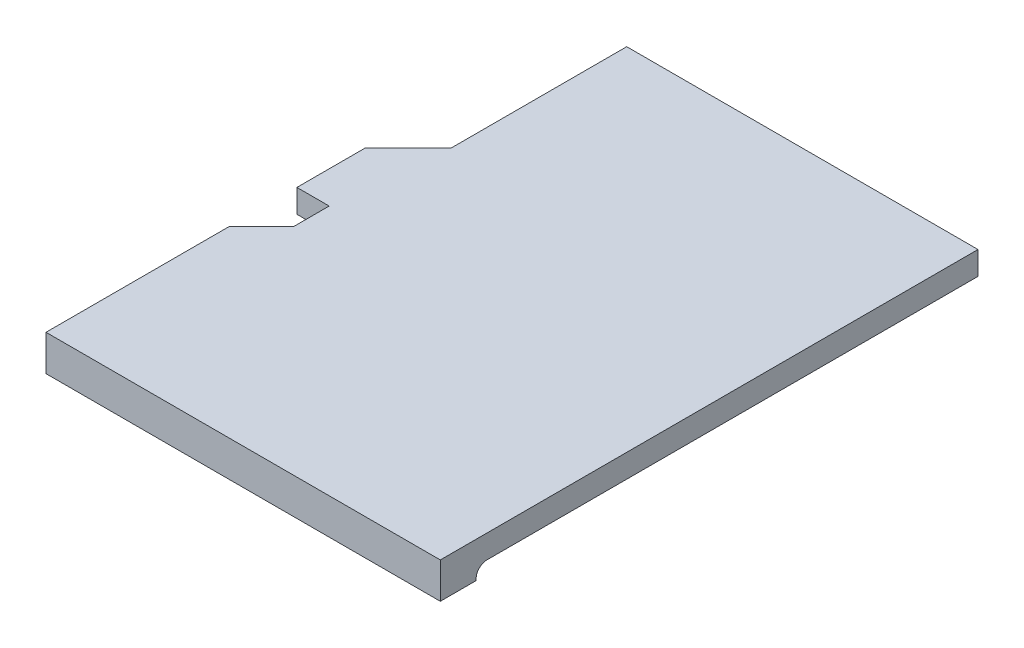
ISO-10303-21;
HEADER;
FILE_DESCRIPTION(('STEP AP214'),'2;1');
FILE_NAME('part.step','',(''),(''),'','','');
FILE_SCHEMA(('AUTOMOTIVE_DESIGN { 1 0 10303 214 1 1 1 1 }'));
ENDSEC;
DATA;
#1=APPLICATION_CONTEXT('core data for automotive mechanical design processes');
#2=APPLICATION_PROTOCOL_DEFINITION('international standard','automotive_design',2000,#1);
#3=PRODUCT_CONTEXT('',#1,'mechanical');
#4=PRODUCT('Part','Part','',(#3));
#5=PRODUCT_RELATED_PRODUCT_CATEGORY('part','',(#4));
#6=PRODUCT_DEFINITION_FORMATION('','',#4);
#7=PRODUCT_DEFINITION_CONTEXT('part definition',#1,'design');
#8=PRODUCT_DEFINITION('design','',#6,#7);
#9=PRODUCT_DEFINITION_SHAPE('','',#8);
#10=(LENGTH_UNIT() NAMED_UNIT(*) SI_UNIT(.MILLI.,.METRE.));
#11=(NAMED_UNIT(*) PLANE_ANGLE_UNIT() SI_UNIT($,.RADIAN.));
#12=(NAMED_UNIT(*) SI_UNIT($,.STERADIAN.) SOLID_ANGLE_UNIT());
#13=UNCERTAINTY_MEASURE_WITH_UNIT(LENGTH_MEASURE(1.E-05),#10,'distance_accuracy_value','');
#14=(GEOMETRIC_REPRESENTATION_CONTEXT(3) GLOBAL_UNCERTAINTY_ASSIGNED_CONTEXT((#13)) GLOBAL_UNIT_ASSIGNED_CONTEXT((#10,
#11,#12)) REPRESENTATION_CONTEXT('',''));
#15=CARTESIAN_POINT('',(0.,0.,0.));
#16=DIRECTION('',(0.,0.,1.));
#17=DIRECTION('',(1.,0.,0.));
#18=AXIS2_PLACEMENT_3D('',#15,#16,#17);
#19=CARTESIAN_POINT('',(0.,0.,36.5));
#20=DIRECTION('',(0.,-1.,0.));
#21=DIRECTION('',(0.,0.,-1.));
#22=AXIS2_PLACEMENT_3D('',#19,#20,#21);
#23=CYLINDRICAL_SURFACE('',#22,30.5);
#24=DIRECTION('',(0.,-1.,0.));
#25=VECTOR('',#24,1.);
#26=CARTESIAN_POINT('',(5.5,0.,6.5));
#27=LINE('',#26,#25);
#28=CARTESIAN_POINT('',(5.5,-0.3,6.5));
#29=VERTEX_POINT('',#28);
#30=CARTESIAN_POINT('',(5.5,-0.35,6.5));
#31=VERTEX_POINT('',#30);
#32=EDGE_CURVE('E118',#29,#31,#27,.T.);
#33=ORIENTED_EDGE('',*,*,#32,.T.);
#34=CARTESIAN_POINT('',(0.,-0.35,36.5));
#35=DIRECTION('',(0.,-1.,0.));
#36=DIRECTION('',(0.,0.,-1.));
#37=AXIS2_PLACEMENT_3D('',#34,#35,#36);
#38=CIRCLE('',#37,30.5);
#39=CARTESIAN_POINT('',(-5.5,-0.35,6.5));
#40=VERTEX_POINT('',#39);
#41=EDGE_CURVE('E138',#40,#31,#38,.T.);
#42=ORIENTED_EDGE('',*,*,#41,.F.);
#43=DIRECTION('',(0.,-1.,0.));
#44=VECTOR('',#43,1.);
#45=CARTESIAN_POINT('',(-5.5,0.,6.5));
#46=LINE('',#45,#44);
#47=CARTESIAN_POINT('',(-5.5,-0.299999999999936,6.5));
#48=VERTEX_POINT('',#47);
#49=EDGE_CURVE('E127',#40,#48,#46,.F.);
#50=ORIENTED_EDGE('',*,*,#49,.T.);
#51=CARTESIAN_POINT('',(0.,-0.300000000000005,36.4999999999999));
#52=DIRECTION('',(0.,1.,0.));
#53=DIRECTION('',(0.,0.,1.));
#54=AXIS2_PLACEMENT_3D('',#51,#52,#53);
#55=CIRCLE('',#54,30.4999999999999);
#56=EDGE_CURVE('E113',#48,#29,#55,.F.);
#57=ORIENTED_EDGE('',*,*,#56,.T.);
#58=EDGE_LOOP('',(#33,#42,#50,#57));
#59=FACE_BOUND('',#58,.T.);
#60=ADVANCED_FACE('F16',(#59),#23,.T.);
#61=CARTESIAN_POINT('',(0.,-0.300000000000007,36.4999999999999));
#62=DIRECTION('',(0.,1.,0.));
#63=DIRECTION('',(0.,0.,1.));
#64=AXIS2_PLACEMENT_3D('',#61,#62,#63);
#65=TOROIDAL_SURFACE('',#64,30.7999999999999,0.300000000000001);
#66=CARTESIAN_POINT('',(0.,0.,36.4999999999999));
#67=DIRECTION('',(0.,-1.,0.));
#68=DIRECTION('',(-0.178571428571428,0.,-0.983926950996851));
#69=AXIS2_PLACEMENT_3D('',#66,#67,#68);
#70=CIRCLE('',#69,30.7999999999999);
#71=CARTESIAN_POINT('',(-5.49999999999999,0.,6.19504990929698));
#72=VERTEX_POINT('',#71);
#73=CARTESIAN_POINT('',(5.5,0.,6.19504990929699));
#74=VERTEX_POINT('',#73);
#75=EDGE_CURVE('E134',#72,#74,#70,.T.);
#76=ORIENTED_EDGE('',*,*,#75,.T.);
#77=CARTESIAN_POINT('',(5.5,-0.3,6.5));
#78=CARTESIAN_POINT('',(5.49999999999996,-0.2833220272923,6.50001549346963));
#79=CARTESIAN_POINT('',(5.49999999999998,-0.266649991355989,6.49858702026892));
#80=CARTESIAN_POINT('',(5.50000000000002,-0.233801123224785,6.49295845943377));
#81=CARTESIAN_POINT('',(5.50000000000004,-0.21762369685712,6.48876184600417));
#82=CARTESIAN_POINT('',(5.49999999999996,-0.186198271619581,6.47771103302167));
#83=CARTESIAN_POINT('',(5.49999999999985,-0.17095057055962,6.47085598704032));
#84=CARTESIAN_POINT('',(5.50000000000015,-0.141812070083495,6.45470279694149));
#85=CARTESIAN_POINT('',(5.50000000000055,-0.127921211183975,6.44540475998965));
#86=CARTESIAN_POINT('',(5.50000000000051,-0.101774813221854,6.42456445317544));
#87=CARTESIAN_POINT('',(5.50000000000006,-0.0895318508629354,6.41300641226746));
#88=CARTESIAN_POINT('',(5.49999999999994,-0.0671233254217907,6.38802611476665));
#89=CARTESIAN_POINT('',(5.50000000000026,-0.0569579996828737,6.37460364548067));
#90=CARTESIAN_POINT('',(5.50000000000031,-0.0388245508854174,6.34605271408475));
#91=CARTESIAN_POINT('',(5.50000000000004,-0.0308934194654272,6.33090078154519));
#92=CARTESIAN_POINT('',(5.49999999999996,-0.0176486358557593,6.2994957466121));
#93=CARTESIAN_POINT('',(5.50000000000014,-0.0123340403630539,6.28324304347134));
#94=CARTESIAN_POINT('',(5.50000000000015,-0.00560463269504171,6.25494252531883));
#95=CARTESIAN_POINT('',(5.50000000000006,-0.00350419527526123,6.24305286728714));
#96=CARTESIAN_POINT('',(5.49999999999994,-0.000701922432729332,6.21912686292336));
#97=CARTESIAN_POINT('',(5.4999999999999,1.8785395189094E-06,6.20709074676156));
#98=CARTESIAN_POINT('',(5.5,0.,6.19504990929699));
#99=B_SPLINE_CURVE_WITH_KNOTS('',3,(#77,#78,#79,#80,#81,#82,#83,#84,#85,#86,#87,#88,#89,#90,#91,
#92,#93,#94,#95,#96,#97,#98),.UNSPECIFIED.,.F.,.F.,(4,2,2,2,2,2,2,2,2,2,4),(0.,
0.0499640333725193,0.0998654774881921,0.14978282297627,0.199697979127058,0.249974761885353,
0.300257284914318,0.351329041840029,0.402382373073721,0.438526066866835,0.474618857831889),.UNSPECIFIED.);
#100=EDGE_CURVE('E121',#29,#74,#99,.T.);
#101=ORIENTED_EDGE('',*,*,#100,.F.);
#102=ORIENTED_EDGE('',*,*,#56,.F.);
#103=CARTESIAN_POINT('',(-5.5,0.,6.19504990929698));
#104=CARTESIAN_POINT('',(-5.49999999999951,1.3359166367053E-05,6.21241243459702));
#105=CARTESIAN_POINT('',(-5.49999999999971,-0.00145847492078227,6.22977221391286));
#106=CARTESIAN_POINT('',(-5.50000000000029,-0.00727537093845298,6.26399834473381));
#107=CARTESIAN_POINT('',(-5.50000000000067,-0.0116195360169983,6.28086484854244));
#108=CARTESIAN_POINT('',(-5.50000000000037,-0.0230876845066247,6.31363832614259));
#109=CARTESIAN_POINT('',(-5.49999999999971,-0.0302134299476659,6.32954468432762));
#110=CARTESIAN_POINT('',(-5.50000000000029,-0.0470507940960684,6.35991909393008));
#111=CARTESIAN_POINT('',(-5.50000000000155,-0.0567616194024485,6.37438758478329));
#112=CARTESIAN_POINT('',(-5.50000000000161,-0.0784294057998133,6.4013604093999));
#113=CARTESIAN_POINT('',(-5.50000000000043,-0.0903696361954466,6.41387817559001));
#114=CARTESIAN_POINT('',(-5.49999999999957,-0.116211132024589,6.43669167210007));
#115=CARTESIAN_POINT('',(-5.49999999999989,-0.130112084961422,6.4469877558478));
#116=CARTESIAN_POINT('',(-5.50000000000012,-0.159253136893745,6.46489826908499));
#117=CARTESIAN_POINT('',(-5.50000000000003,-0.174469702927339,6.47255103554552));
#118=CARTESIAN_POINT('',(-5.49999999999997,-0.205980556919419,6.48514460204624));
#119=CARTESIAN_POINT('',(-5.5,-0.222273944317636,6.49008763690061));
#120=CARTESIAN_POINT('',(-5.50000000000001,-0.248909603235749,6.49572631466867));
#121=CARTESIAN_POINT('',(-5.5,-0.259068674145312,6.49732802223716));
#122=CARTESIAN_POINT('',(-5.5,-0.27948357873713,6.49946458489194));
#123=CARTESIAN_POINT('',(-5.5,-0.289739252276531,6.50000097072089));
#124=CARTESIAN_POINT('',(-5.5,-0.299999999999933,6.5));
#125=B_SPLINE_CURVE_WITH_KNOTS('',3,(#103,#104,#105,#106,#107,#108,#109,#110,#111,#112,#113,
#114,#115,#116,#117,#118,#119,#120,#121,#122,#123,#124),.UNSPECIFIED.,.F.,.F.,(4,2,2,2,2,2,2,2,
2,2,4),(0.,0.0520216922137013,0.104027148924237,0.156065602799876,0.208088103646515,
0.259734841042157,0.31137335634877,0.362227955165807,0.413040549003683,0.443843165959391,
0.474601491046888),.UNSPECIFIED.);
#126=EDGE_CURVE('E137',#72,#48,#125,.T.);
#127=ORIENTED_EDGE('',*,*,#126,.F.);
#128=EDGE_LOOP('',(#76,#101,#102,#127));
#129=FACE_BOUND('',#128,.T.);
#130=ADVANCED_FACE('F132',(#129),#65,.F.);
#131=CARTESIAN_POINT('',(0.,-0.35,6.93372741582503));
#132=DIRECTION('',(0.,-1.,0.));
#133=DIRECTION('',(0.,0.,-1.));
#134=AXIS2_PLACEMENT_3D('',#131,#132,#133);
#135=PLANE('',#134);
#136=DIRECTION('',(0.,0.,-1.));
#137=VECTOR('',#136,1.);
#138=CARTESIAN_POINT('',(5.5,-0.35,6.93372741582503));
#139=LINE('',#138,#137);
#140=CARTESIAN_POINT('',(5.5,-0.35,7.5));
#141=VERTEX_POINT('',#140);
#142=EDGE_CURVE('E124',#31,#141,#139,.F.);
#143=ORIENTED_EDGE('',*,*,#142,.T.);
#144=DIRECTION('',(1.,0.,0.));
#145=VECTOR('',#144,1.);
#146=CARTESIAN_POINT('',(-5.5,-0.35,7.5));
#147=LINE('',#146,#145);
#148=CARTESIAN_POINT('',(-5.5,-0.35,7.5));
#149=VERTEX_POINT('',#148);
#150=EDGE_CURVE('E228',#149,#141,#147,.T.);
#151=ORIENTED_EDGE('',*,*,#150,.F.);
#152=DIRECTION('',(0.,0.,1.));
#153=VECTOR('',#152,1.);
#154=CARTESIAN_POINT('',(-5.5,-0.35,2.4));
#155=LINE('',#154,#153);
#156=EDGE_CURVE('E204',#40,#149,#155,.T.);
#157=ORIENTED_EDGE('',*,*,#156,.F.);
#158=ORIENTED_EDGE('',*,*,#41,.T.);
#159=EDGE_LOOP('',(#143,#151,#157,#158));
#160=FACE_BOUND('',#159,.T.);
#161=ADVANCED_FACE('F172',(#160),#135,.T.);
#162=CARTESIAN_POINT('',(0.0936244587815548,0.,0.17467868973583));
#163=DIRECTION('',(0.,1.,0.));
#164=DIRECTION('',(0.,0.,1.));
#165=AXIS2_PLACEMENT_3D('',#162,#163,#164);
#166=PLANE('',#165);
#167=DIRECTION('',(0.,0.,1.));
#168=VECTOR('',#167,1.);
#169=CARTESIAN_POINT('',(-4.6,0.,0.5));
#170=LINE('',#169,#168);
#171=CARTESIAN_POINT('',(-4.6,0.,0.5));
#172=VERTEX_POINT('',#171);
#173=CARTESIAN_POINT('',(-4.6,0.,1.5));
#174=VERTEX_POINT('',#173);
#175=EDGE_CURVE('E239',#172,#174,#170,.T.);
#176=ORIENTED_EDGE('',*,*,#175,.F.);
#177=DIRECTION('',(1.,0.,0.));
#178=VECTOR('',#177,1.);
#179=CARTESIAN_POINT('',(-5.5,0.,0.5));
#180=LINE('',#179,#178);
#181=CARTESIAN_POINT('',(-5.5,0.,0.5));
#182=VERTEX_POINT('',#181);
#183=EDGE_CURVE('E242',#182,#172,#180,.T.);
#184=ORIENTED_EDGE('',*,*,#183,.F.);
#185=DIRECTION('',(0.,0.,1.));
#186=VECTOR('',#185,1.);
#187=CARTESIAN_POINT('',(-5.5,0.,-1.4));
#188=LINE('',#187,#186);
#189=CARTESIAN_POINT('',(-5.5,0.,-1.4));
#190=VERTEX_POINT('',#189);
#191=EDGE_CURVE('E260',#190,#182,#188,.T.);
#192=ORIENTED_EDGE('',*,*,#191,.F.);
#193=DIRECTION('',(-0.707106781186548,0.,0.707106781186547));
#194=VECTOR('',#193,1.);
#195=CARTESIAN_POINT('',(-4.3,0.,-2.6));
#196=LINE('',#195,#194);
#197=CARTESIAN_POINT('',(-4.3,0.,-2.6));
#198=VERTEX_POINT('',#197);
#199=EDGE_CURVE('E298',#198,#190,#196,.T.);
#200=ORIENTED_EDGE('',*,*,#199,.F.);
#201=DIRECTION('',(0.,0.,1.));
#202=VECTOR('',#201,1.);
#203=CARTESIAN_POINT('',(-4.3,0.,-7.5));
#204=LINE('',#203,#202);
#205=CARTESIAN_POINT('',(-4.3,0.,-7.5));
#206=VERTEX_POINT('',#205);
#207=EDGE_CURVE('E194',#206,#198,#204,.T.);
#208=ORIENTED_EDGE('',*,*,#207,.F.);
#209=DIRECTION('',(-1.,0.,0.));
#210=VECTOR('',#209,1.);
#211=CARTESIAN_POINT('',(5.5,0.,-7.5));
#212=LINE('',#211,#210);
#213=CARTESIAN_POINT('',(5.5,0.,-7.5));
#214=VERTEX_POINT('',#213);
#215=EDGE_CURVE('E180',#214,#206,#212,.T.);
#216=ORIENTED_EDGE('',*,*,#215,.F.);
#217=DIRECTION('',(0.,0.,-1.));
#218=VECTOR('',#217,1.);
#219=CARTESIAN_POINT('',(5.5,0.,7.5));
#220=LINE('',#219,#218);
#221=EDGE_CURVE('E189',#74,#214,#220,.T.);
#222=ORIENTED_EDGE('',*,*,#221,.F.);
#223=ORIENTED_EDGE('',*,*,#75,.F.);
#224=DIRECTION('',(0.,0.,1.));
#225=VECTOR('',#224,1.);
#226=CARTESIAN_POINT('',(-5.5,0.,2.4));
#227=LINE('',#226,#225);
#228=CARTESIAN_POINT('',(-5.5,0.,2.4));
#229=VERTEX_POINT('',#228);
#230=EDGE_CURVE('E203',#229,#72,#227,.T.);
#231=ORIENTED_EDGE('',*,*,#230,.F.);
#232=DIRECTION('',(-0.707106781186547,0.,0.707106781186548));
#233=VECTOR('',#232,1.);
#234=CARTESIAN_POINT('',(-4.6,0.,1.5));
#235=LINE('',#234,#233);
#236=EDGE_CURVE('E207',#174,#229,#235,.T.);
#237=ORIENTED_EDGE('',*,*,#236,.F.);
#238=EDGE_LOOP('',(#176,#184,#192,#200,#208,#216,#222,#223,#231,#237));
#239=FACE_BOUND('',#238,.T.);
#240=ADVANCED_FACE('F168',(#239),#166,.F.);
#241=CARTESIAN_POINT('',(-5.5,0.,0.5));
#242=DIRECTION('',(0.,0.,1.));
#243=DIRECTION('',(1.,0.,0.));
#244=AXIS2_PLACEMENT_3D('',#241,#242,#243);
#245=PLANE('',#244);
#246=DIRECTION('',(1.,0.,0.));
#247=VECTOR('',#246,1.);
#248=CARTESIAN_POINT('',(0.0936244587815549,0.65,0.5));
#249=LINE('',#248,#247);
#250=CARTESIAN_POINT('',(-5.5,0.65,0.5));
#251=VERTEX_POINT('',#250);
#252=CARTESIAN_POINT('',(-4.6,0.65,0.5));
#253=VERTEX_POINT('',#252);
#254=EDGE_CURVE('E303',#251,#253,#249,.T.);
#255=ORIENTED_EDGE('',*,*,#254,.F.);
#256=DIRECTION('',(0.,1.,0.));
#257=VECTOR('',#256,1.);
#258=CARTESIAN_POINT('',(-5.5,0.,0.5));
#259=LINE('',#258,#257);
#260=EDGE_CURVE('E257',#182,#251,#259,.T.);
#261=ORIENTED_EDGE('',*,*,#260,.F.);
#262=ORIENTED_EDGE('',*,*,#183,.T.);
#263=DIRECTION('',(0.,1.,0.));
#264=VECTOR('',#263,1.);
#265=CARTESIAN_POINT('',(-4.6,0.,0.5));
#266=LINE('',#265,#264);
#267=EDGE_CURVE('E210',#253,#172,#266,.F.);
#268=ORIENTED_EDGE('',*,*,#267,.F.);
#269=EDGE_LOOP('',(#255,#261,#262,#268));
#270=FACE_BOUND('',#269,.T.);
#271=ADVANCED_FACE('F164',(#270),#245,.T.);
#272=CARTESIAN_POINT('',(-4.6,0.,0.5));
#273=DIRECTION('',(-1.,0.,0.));
#274=DIRECTION('',(0.,0.,1.));
#275=AXIS2_PLACEMENT_3D('',#272,#273,#274);
#276=PLANE('',#275);
#277=DIRECTION('',(0.,0.,1.));
#278=VECTOR('',#277,1.);
#279=CARTESIAN_POINT('',(-4.6,0.65,0.17467868973583));
#280=LINE('',#279,#278);
#281=CARTESIAN_POINT('',(-4.6,0.65,1.5));
#282=VERTEX_POINT('',#281);
#283=EDGE_CURVE('E222',#253,#282,#280,.T.);
#284=ORIENTED_EDGE('',*,*,#283,.F.);
#285=ORIENTED_EDGE('',*,*,#267,.T.);
#286=ORIENTED_EDGE('',*,*,#175,.T.);
#287=DIRECTION('',(0.,1.,0.));
#288=VECTOR('',#287,1.);
#289=CARTESIAN_POINT('',(-4.6,0.,1.5));
#290=LINE('',#289,#288);
#291=EDGE_CURVE('E209',#282,#174,#290,.F.);
#292=ORIENTED_EDGE('',*,*,#291,.F.);
#293=EDGE_LOOP('',(#284,#285,#286,#292));
#294=FACE_BOUND('',#293,.T.);
#295=ADVANCED_FACE('F160',(#294),#276,.T.);
#296=CARTESIAN_POINT('',(-4.6,0.,1.5));
#297=DIRECTION('',(-0.707106781186548,0.,-0.707106781186547));
#298=DIRECTION('',(-0.707106781186547,0.,0.707106781186548));
#299=AXIS2_PLACEMENT_3D('',#296,#297,#298);
#300=PLANE('',#299);
#301=DIRECTION('',(-0.707106781186548,0.,0.707106781186548));
#302=VECTOR('',#301,1.);
#303=CARTESIAN_POINT('',(-4.6,0.65,1.5));
#304=LINE('',#303,#302);
#305=CARTESIAN_POINT('',(-5.5,0.65,2.4));
#306=VERTEX_POINT('',#305);
#307=EDGE_CURVE('E217',#282,#306,#304,.T.);
#308=ORIENTED_EDGE('',*,*,#307,.F.);
#309=ORIENTED_EDGE('',*,*,#291,.T.);
#310=ORIENTED_EDGE('',*,*,#236,.T.);
#311=DIRECTION('',(0.,1.,0.));
#312=VECTOR('',#311,1.);
#313=CARTESIAN_POINT('',(-5.5,0.,2.4));
#314=LINE('',#313,#312);
#315=EDGE_CURVE('E200',#306,#229,#314,.F.);
#316=ORIENTED_EDGE('',*,*,#315,.F.);
#317=EDGE_LOOP('',(#308,#309,#310,#316));
#318=FACE_BOUND('',#317,.T.);
#319=ADVANCED_FACE('F156',(#318),#300,.T.);
#320=CARTESIAN_POINT('',(-5.5,0.,2.4));
#321=DIRECTION('',(-1.,0.,0.));
#322=DIRECTION('',(0.,0.,1.));
#323=AXIS2_PLACEMENT_3D('',#320,#321,#322);
#324=PLANE('',#323);
#325=ORIENTED_EDGE('',*,*,#126,.T.);
#326=ORIENTED_EDGE('',*,*,#49,.F.);
#327=ORIENTED_EDGE('',*,*,#156,.T.);
#328=DIRECTION('',(0.,1.,0.));
#329=VECTOR('',#328,1.);
#330=CARTESIAN_POINT('',(-5.5,0.,7.5));
#331=LINE('',#330,#329);
#332=CARTESIAN_POINT('',(-5.5,0.65,7.5));
#333=VERTEX_POINT('',#332);
#334=EDGE_CURVE('E232',#333,#149,#331,.F.);
#335=ORIENTED_EDGE('',*,*,#334,.F.);
#336=DIRECTION('',(0.,0.,1.));
#337=VECTOR('',#336,1.);
#338=CARTESIAN_POINT('',(-5.5,0.65,0.17467868973583));
#339=LINE('',#338,#337);
#340=EDGE_CURVE('E213',#306,#333,#339,.T.);
#341=ORIENTED_EDGE('',*,*,#340,.F.);
#342=ORIENTED_EDGE('',*,*,#315,.T.);
#343=ORIENTED_EDGE('',*,*,#230,.T.);
#344=EDGE_LOOP('',(#325,#326,#327,#335,#341,#342,#343));
#345=FACE_BOUND('',#344,.T.);
#346=ADVANCED_FACE('F150',(#345),#324,.T.);
#347=CARTESIAN_POINT('',(-5.5,0.,7.5));
#348=DIRECTION('',(0.,0.,1.));
#349=DIRECTION('',(1.,0.,0.));
#350=AXIS2_PLACEMENT_3D('',#347,#348,#349);
#351=PLANE('',#350);
#352=ORIENTED_EDGE('',*,*,#334,.T.);
#353=ORIENTED_EDGE('',*,*,#150,.T.);
#354=DIRECTION('',(0.,1.,0.));
#355=VECTOR('',#354,1.);
#356=CARTESIAN_POINT('',(5.5,0.,7.5));
#357=LINE('',#356,#355);
#358=CARTESIAN_POINT('',(5.5,0.65,7.5));
#359=VERTEX_POINT('',#358);
#360=EDGE_CURVE('E231',#359,#141,#357,.F.);
#361=ORIENTED_EDGE('',*,*,#360,.F.);
#362=DIRECTION('',(1.,0.,0.));
#363=VECTOR('',#362,1.);
#364=CARTESIAN_POINT('',(0.0936244587815549,0.65,7.5));
#365=LINE('',#364,#363);
#366=EDGE_CURVE('E216',#333,#359,#365,.T.);
#367=ORIENTED_EDGE('',*,*,#366,.F.);
#368=EDGE_LOOP('',(#352,#353,#361,#367));
#369=FACE_BOUND('',#368,.T.);
#370=ADVANCED_FACE('F155',(#369),#351,.T.);
#371=CARTESIAN_POINT('',(5.5,0.,7.5));
#372=DIRECTION('',(1.,0.,0.));
#373=DIRECTION('',(0.,0.,-1.));
#374=AXIS2_PLACEMENT_3D('',#371,#372,#373);
#375=PLANE('',#374);
#376=DIRECTION('',(0.,1.,0.));
#377=VECTOR('',#376,1.);
#378=CARTESIAN_POINT('',(5.5,0.,-7.5));
#379=LINE('',#378,#377);
#380=CARTESIAN_POINT('',(5.5,0.65,-7.5));
#381=VERTEX_POINT('',#380);
#382=EDGE_CURVE('E188',#381,#214,#379,.F.);
#383=ORIENTED_EDGE('',*,*,#382,.F.);
#384=DIRECTION('',(0.,0.,1.));
#385=VECTOR('',#384,1.);
#386=CARTESIAN_POINT('',(5.5,0.65,0.17467868973583));
#387=LINE('',#386,#385);
#388=EDGE_CURVE('E310',#359,#381,#387,.F.);
#389=ORIENTED_EDGE('',*,*,#388,.F.);
#390=ORIENTED_EDGE('',*,*,#360,.T.);
#391=ORIENTED_EDGE('',*,*,#142,.F.);
#392=ORIENTED_EDGE('',*,*,#32,.F.);
#393=ORIENTED_EDGE('',*,*,#100,.T.);
#394=ORIENTED_EDGE('',*,*,#221,.T.);
#395=EDGE_LOOP('',(#383,#389,#390,#391,#392,#393,#394));
#396=FACE_BOUND('',#395,.T.);
#397=ADVANCED_FACE('F119',(#396),#375,.T.);
#398=CARTESIAN_POINT('',(5.5,0.,-7.5));
#399=DIRECTION('',(0.,0.,-1.));
#400=DIRECTION('',(-1.,0.,0.));
#401=AXIS2_PLACEMENT_3D('',#398,#399,#400);
#402=PLANE('',#401);
#403=DIRECTION('',(1.,0.,0.));
#404=VECTOR('',#403,1.);
#405=CARTESIAN_POINT('',(0.0936244587815549,0.65,-7.5));
#406=LINE('',#405,#404);
#407=CARTESIAN_POINT('',(-4.3,0.65,-7.5));
#408=VERTEX_POINT('',#407);
#409=EDGE_CURVE('E313',#381,#408,#406,.F.);
#410=ORIENTED_EDGE('',*,*,#409,.F.);
#411=ORIENTED_EDGE('',*,*,#382,.T.);
#412=ORIENTED_EDGE('',*,*,#215,.T.);
#413=DIRECTION('',(0.,1.,0.));
#414=VECTOR('',#413,1.);
#415=CARTESIAN_POINT('',(-4.3,0.,-7.5));
#416=LINE('',#415,#414);
#417=EDGE_CURVE('E295',#408,#206,#416,.F.);
#418=ORIENTED_EDGE('',*,*,#417,.F.);
#419=EDGE_LOOP('',(#410,#411,#412,#418));
#420=FACE_BOUND('',#419,.T.);
#421=ADVANCED_FACE('F328',(#420),#402,.T.);
#422=CARTESIAN_POINT('',(-4.3,0.,-7.5));
#423=DIRECTION('',(-1.,0.,0.));
#424=DIRECTION('',(0.,0.,1.));
#425=AXIS2_PLACEMENT_3D('',#422,#423,#424);
#426=PLANE('',#425);
#427=DIRECTION('',(0.,0.,1.));
#428=VECTOR('',#427,1.);
#429=CARTESIAN_POINT('',(-4.3,0.65,0.17467868973583));
#430=LINE('',#429,#428);
#431=CARTESIAN_POINT('',(-4.3,0.65,-2.6));
#432=VERTEX_POINT('',#431);
#433=EDGE_CURVE('E316',#408,#432,#430,.T.);
#434=ORIENTED_EDGE('',*,*,#433,.F.);
#435=ORIENTED_EDGE('',*,*,#417,.T.);
#436=ORIENTED_EDGE('',*,*,#207,.T.);
#437=DIRECTION('',(0.,1.,0.));
#438=VECTOR('',#437,1.);
#439=CARTESIAN_POINT('',(-4.3,0.,-2.6));
#440=LINE('',#439,#438);
#441=EDGE_CURVE('E265',#432,#198,#440,.F.);
#442=ORIENTED_EDGE('',*,*,#441,.F.);
#443=EDGE_LOOP('',(#434,#435,#436,#442));
#444=FACE_BOUND('',#443,.T.);
#445=ADVANCED_FACE('F325',(#444),#426,.T.);
#446=CARTESIAN_POINT('',(-4.3,0.,-2.6));
#447=DIRECTION('',(-0.707106781186547,0.,-0.707106781186548));
#448=DIRECTION('',(-0.707106781186548,0.,0.707106781186547));
#449=AXIS2_PLACEMENT_3D('',#446,#447,#448);
#450=PLANE('',#449);
#451=DIRECTION('',(-0.707106781186548,0.,0.707106781186547));
#452=VECTOR('',#451,1.);
#453=CARTESIAN_POINT('',(-4.3,0.65,-2.6));
#454=LINE('',#453,#452);
#455=CARTESIAN_POINT('',(-5.5,0.65,-1.4));
#456=VERTEX_POINT('',#455);
#457=EDGE_CURVE('E29',#432,#456,#454,.T.);
#458=ORIENTED_EDGE('',*,*,#457,.F.);
#459=ORIENTED_EDGE('',*,*,#441,.T.);
#460=ORIENTED_EDGE('',*,*,#199,.T.);
#461=DIRECTION('',(0.,1.,0.));
#462=VECTOR('',#461,1.);
#463=CARTESIAN_POINT('',(-5.5,0.,-1.4));
#464=LINE('',#463,#462);
#465=EDGE_CURVE('E38',#456,#190,#464,.F.);
#466=ORIENTED_EDGE('',*,*,#465,.F.);
#467=EDGE_LOOP('',(#458,#459,#460,#466));
#468=FACE_BOUND('',#467,.T.);
#469=ADVANCED_FACE('F323',(#468),#450,.T.);
#470=CARTESIAN_POINT('',(-5.5,0.,-1.4));
#471=DIRECTION('',(-1.,0.,0.));
#472=DIRECTION('',(0.,0.,1.));
#473=AXIS2_PLACEMENT_3D('',#470,#471,#472);
#474=PLANE('',#473);
#475=DIRECTION('',(0.,0.,1.));
#476=VECTOR('',#475,1.);
#477=CARTESIAN_POINT('',(-5.5,0.65,0.17467868973583));
#478=LINE('',#477,#476);
#479=EDGE_CURVE('E11',#456,#251,#478,.T.);
#480=ORIENTED_EDGE('',*,*,#479,.F.);
#481=ORIENTED_EDGE('',*,*,#465,.T.);
#482=ORIENTED_EDGE('',*,*,#191,.T.);
#483=ORIENTED_EDGE('',*,*,#260,.T.);
#484=EDGE_LOOP('',(#480,#481,#482,#483));
#485=FACE_BOUND('',#484,.T.);
#486=ADVANCED_FACE('F337',(#485),#474,.T.);
#487=CARTESIAN_POINT('',(0.0936244587815549,0.65,0.17467868973583));
#488=DIRECTION('',(0.,1.,0.));
#489=DIRECTION('',(0.,0.,1.));
#490=AXIS2_PLACEMENT_3D('',#487,#488,#489);
#491=PLANE('',#490);
#492=ORIENTED_EDGE('',*,*,#457,.T.);
#493=ORIENTED_EDGE('',*,*,#479,.T.);
#494=ORIENTED_EDGE('',*,*,#254,.T.);
#495=ORIENTED_EDGE('',*,*,#283,.T.);
#496=ORIENTED_EDGE('',*,*,#307,.T.);
#497=ORIENTED_EDGE('',*,*,#340,.T.);
#498=ORIENTED_EDGE('',*,*,#366,.T.);
#499=ORIENTED_EDGE('',*,*,#388,.T.);
#500=ORIENTED_EDGE('',*,*,#409,.T.);
#501=ORIENTED_EDGE('',*,*,#433,.T.);
#502=EDGE_LOOP('',(#492,#493,#494,#495,#496,#497,#498,#499,#500,#501));
#503=FACE_BOUND('',#502,.T.);
#504=ADVANCED_FACE('F321',(#503),#491,.T.);
#505=CLOSED_SHELL('',(#60,#130,#161,#240,#271,#295,#319,#346,#370,#397,#421,#445,#469,#486,#504));
#506=MANIFOLD_SOLID_BREP('B1',#505);
#507=ADVANCED_BREP_SHAPE_REPRESENTATION('',(#18,#506),#14);
#508=SHAPE_DEFINITION_REPRESENTATION(#9,#507);
ENDSEC;
END-ISO-10303-21;
